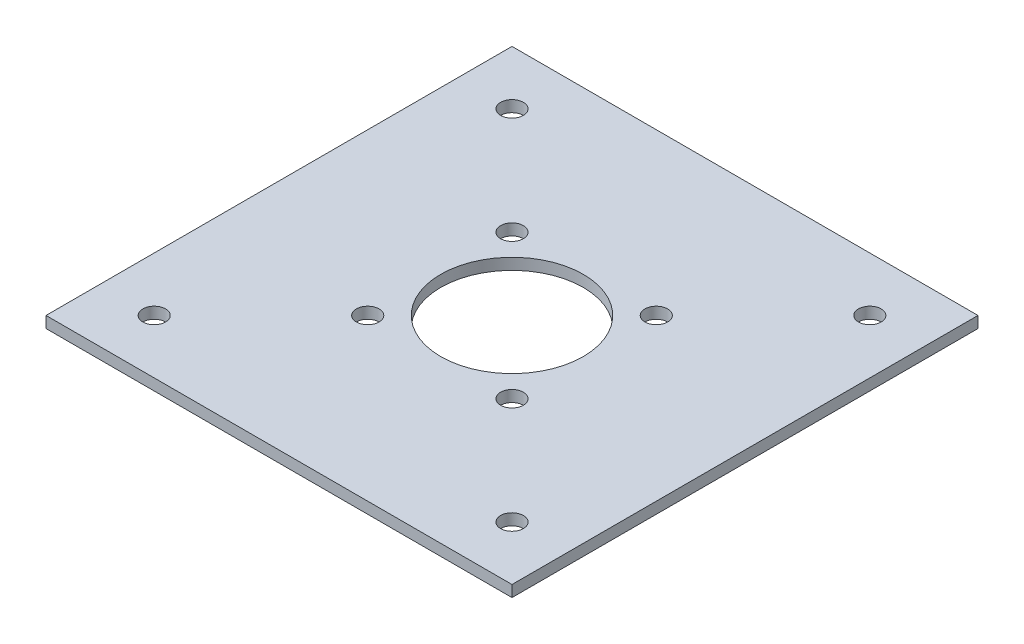
ISO-10303-21;
HEADER;
FILE_DESCRIPTION(('STEP AP214'),'2;1');
FILE_NAME('part.step','',(''),(''),'','','');
FILE_SCHEMA(('AUTOMOTIVE_DESIGN { 1 0 10303 214 1 1 1 1 }'));
ENDSEC;
DATA;
#1=APPLICATION_CONTEXT('core data for automotive mechanical design processes');
#2=APPLICATION_PROTOCOL_DEFINITION('international standard','automotive_design',2000,#1);
#3=PRODUCT_CONTEXT('',#1,'mechanical');
#4=PRODUCT('Part','Part','',(#3));
#5=PRODUCT_RELATED_PRODUCT_CATEGORY('part','',(#4));
#6=PRODUCT_DEFINITION_FORMATION('','',#4);
#7=PRODUCT_DEFINITION_CONTEXT('part definition',#1,'design');
#8=PRODUCT_DEFINITION('design','',#6,#7);
#9=PRODUCT_DEFINITION_SHAPE('','',#8);
#10=(LENGTH_UNIT() NAMED_UNIT(*) SI_UNIT(.MILLI.,.METRE.));
#11=(NAMED_UNIT(*) PLANE_ANGLE_UNIT() SI_UNIT($,.RADIAN.));
#12=(NAMED_UNIT(*) SI_UNIT($,.STERADIAN.) SOLID_ANGLE_UNIT());
#13=UNCERTAINTY_MEASURE_WITH_UNIT(LENGTH_MEASURE(1.E-05),#10,'distance_accuracy_value','');
#14=(GEOMETRIC_REPRESENTATION_CONTEXT(3) GLOBAL_UNCERTAINTY_ASSIGNED_CONTEXT((#13)) GLOBAL_UNIT_ASSIGNED_CONTEXT((#10,
#11,#12)) REPRESENTATION_CONTEXT('',''));
#15=CARTESIAN_POINT('',(0.,0.,0.));
#16=DIRECTION('',(0.,0.,1.));
#17=DIRECTION('',(1.,0.,0.));
#18=AXIS2_PLACEMENT_3D('',#15,#16,#17);
#19=CARTESIAN_POINT('',(0.,2.,-82.042));
#20=DIRECTION('',(0.,-1.,0.));
#21=DIRECTION('',(0.,0.,-1.));
#22=AXIS2_PLACEMENT_3D('',#19,#20,#21);
#23=PLANE('',#22);
#24=CARTESIAN_POINT('',(41.021,2.,-41.021));
#25=DIRECTION('',(0.,1.,0.));
#26=DIRECTION('',(0.,0.,1.));
#27=AXIS2_PLACEMENT_3D('',#24,#25,#26);
#28=CIRCLE('',#27,12.5476);
#29=CARTESIAN_POINT('',(41.021,2.,-28.4734));
#30=VERTEX_POINT('',#29);
#31=EDGE_CURVE('E159',#30,#30,#28,.T.);
#32=ORIENTED_EDGE('',*,*,#31,.F.);
#33=EDGE_LOOP('',(#32));
#34=FACE_BOUND('',#33,.T.);
#35=CARTESIAN_POINT('',(9.52500000000001,2.,-9.52500000000001));
#36=DIRECTION('',(0.,1.,0.));
#37=DIRECTION('',(0.,0.,1.));
#38=AXIS2_PLACEMENT_3D('',#35,#36,#37);
#39=CIRCLE('',#38,2.);
#40=CARTESIAN_POINT('',(9.52500000000001,2.,-7.52500000000001));
#41=VERTEX_POINT('',#40);
#42=EDGE_CURVE('E150',#41,#41,#39,.T.);
#43=ORIENTED_EDGE('',*,*,#42,.F.);
#44=EDGE_LOOP('',(#43));
#45=FACE_BOUND('',#44,.T.);
#46=CARTESIAN_POINT('',(53.721,2.,-53.721));
#47=DIRECTION('',(0.,-1.,0.));
#48=DIRECTION('',(0.,0.,-1.));
#49=AXIS2_PLACEMENT_3D('',#46,#47,#48);
#50=CIRCLE('',#49,2.);
#51=CARTESIAN_POINT('',(53.721,2.,-55.721));
#52=VERTEX_POINT('',#51);
#53=EDGE_CURVE('E132',#52,#52,#50,.T.);
#54=ORIENTED_EDGE('',*,*,#53,.T.);
#55=EDGE_LOOP('',(#54));
#56=FACE_BOUND('',#55,.T.);
#57=CARTESIAN_POINT('',(53.721,2.,-28.321));
#58=DIRECTION('',(0.,1.,0.));
#59=DIRECTION('',(0.,0.,1.));
#60=AXIS2_PLACEMENT_3D('',#57,#58,#59);
#61=CIRCLE('',#60,2.);
#62=CARTESIAN_POINT('',(53.721,2.,-26.321));
#63=VERTEX_POINT('',#62);
#64=EDGE_CURVE('E126',#63,#63,#61,.T.);
#65=ORIENTED_EDGE('',*,*,#64,.F.);
#66=EDGE_LOOP('',(#65));
#67=FACE_BOUND('',#66,.T.);
#68=CARTESIAN_POINT('',(9.52500000000001,2.,-72.517));
#69=DIRECTION('',(0.,-1.,0.));
#70=DIRECTION('',(0.,0.,-1.));
#71=AXIS2_PLACEMENT_3D('',#68,#69,#70);
#72=CIRCLE('',#71,2.);
#73=CARTESIAN_POINT('',(9.52500000000001,2.,-74.517));
#74=VERTEX_POINT('',#73);
#75=EDGE_CURVE('E111',#74,#74,#72,.T.);
#76=ORIENTED_EDGE('',*,*,#75,.T.);
#77=EDGE_LOOP('',(#76));
#78=FACE_BOUND('',#77,.T.);
#79=DIRECTION('',(0.,0.,1.));
#80=VECTOR('',#79,1.);
#81=CARTESIAN_POINT('',(0.,2.,0.));
#82=LINE('',#81,#80);
#83=CARTESIAN_POINT('',(0.,2.,-82.042));
#84=VERTEX_POINT('',#83);
#85=CARTESIAN_POINT('',(0.,2.,0.));
#86=VERTEX_POINT('',#85);
#87=EDGE_CURVE('E84',#84,#86,#82,.T.);
#88=ORIENTED_EDGE('',*,*,#87,.T.);
#89=DIRECTION('',(1.,0.,0.));
#90=VECTOR('',#89,1.);
#91=CARTESIAN_POINT('',(0.,2.,0.));
#92=LINE('',#91,#90);
#93=CARTESIAN_POINT('',(82.042,2.,0.));
#94=VERTEX_POINT('',#93);
#95=EDGE_CURVE('E79',#86,#94,#92,.T.);
#96=ORIENTED_EDGE('',*,*,#95,.T.);
#97=DIRECTION('',(0.,0.,-1.));
#98=VECTOR('',#97,1.);
#99=CARTESIAN_POINT('',(82.042,2.,0.));
#100=LINE('',#99,#98);
#101=CARTESIAN_POINT('',(82.042,2.,-82.042));
#102=VERTEX_POINT('',#101);
#103=EDGE_CURVE('E82',#94,#102,#100,.T.);
#104=ORIENTED_EDGE('',*,*,#103,.T.);
#105=DIRECTION('',(-1.,0.,0.));
#106=VECTOR('',#105,1.);
#107=CARTESIAN_POINT('',(0.,2.,-82.042));
#108=LINE('',#107,#106);
#109=EDGE_CURVE('E49',#102,#84,#108,.T.);
#110=ORIENTED_EDGE('',*,*,#109,.T.);
#111=EDGE_LOOP('',(#88,#96,#104,#110));
#112=FACE_BOUND('',#111,.T.);
#113=CARTESIAN_POINT('',(28.321,2.,-53.721));
#114=DIRECTION('',(0.,1.,0.));
#115=DIRECTION('',(0.,0.,1.));
#116=AXIS2_PLACEMENT_3D('',#113,#114,#115);
#117=CIRCLE('',#116,2.);
#118=CARTESIAN_POINT('',(28.321,2.,-51.721));
#119=VERTEX_POINT('',#118);
#120=EDGE_CURVE('E114',#119,#119,#117,.T.);
#121=ORIENTED_EDGE('',*,*,#120,.F.);
#122=EDGE_LOOP('',(#121));
#123=FACE_BOUND('',#122,.T.);
#124=CARTESIAN_POINT('',(28.321,2.,-28.321));
#125=DIRECTION('',(0.,-1.,0.));
#126=DIRECTION('',(0.,0.,-1.));
#127=AXIS2_PLACEMENT_3D('',#124,#125,#126);
#128=CIRCLE('',#127,2.);
#129=CARTESIAN_POINT('',(28.321,2.,-30.321));
#130=VERTEX_POINT('',#129);
#131=EDGE_CURVE('E120',#130,#130,#128,.T.);
#132=ORIENTED_EDGE('',*,*,#131,.T.);
#133=EDGE_LOOP('',(#132));
#134=FACE_BOUND('',#133,.T.);
#135=CARTESIAN_POINT('',(72.517,2.,-72.517));
#136=DIRECTION('',(0.,1.,0.));
#137=DIRECTION('',(0.,0.,1.));
#138=AXIS2_PLACEMENT_3D('',#135,#136,#137);
#139=CIRCLE('',#138,2.);
#140=CARTESIAN_POINT('',(72.517,2.,-70.517));
#141=VERTEX_POINT('',#140);
#142=EDGE_CURVE('E138',#141,#141,#139,.T.);
#143=ORIENTED_EDGE('',*,*,#142,.F.);
#144=EDGE_LOOP('',(#143));
#145=FACE_BOUND('',#144,.T.);
#146=CARTESIAN_POINT('',(72.517,2.,-9.52500000000001));
#147=DIRECTION('',(0.,-1.,0.));
#148=DIRECTION('',(0.,0.,-1.));
#149=AXIS2_PLACEMENT_3D('',#146,#147,#148);
#150=CIRCLE('',#149,2.);
#151=CARTESIAN_POINT('',(72.517,2.,-11.525));
#152=VERTEX_POINT('',#151);
#153=EDGE_CURVE('E144',#152,#152,#150,.T.);
#154=ORIENTED_EDGE('',*,*,#153,.T.);
#155=EDGE_LOOP('',(#154));
#156=FACE_BOUND('',#155,.T.);
#157=ADVANCED_FACE('F32',(#34,#45,#56,#67,#78,#112,#123,#134,#145,#156),#23,.F.);
#158=CARTESIAN_POINT('',(0.,0.,-82.042));
#159=DIRECTION('',(0.,-1.,0.));
#160=DIRECTION('',(0.,0.,-1.));
#161=AXIS2_PLACEMENT_3D('',#158,#159,#160);
#162=PLANE('',#161);
#163=CARTESIAN_POINT('',(41.021,0.,-41.021));
#164=DIRECTION('',(0.,1.,0.));
#165=DIRECTION('',(0.,0.,1.));
#166=AXIS2_PLACEMENT_3D('',#163,#164,#165);
#167=CIRCLE('',#166,12.5476);
#168=CARTESIAN_POINT('',(41.021,0.,-28.4734));
#169=VERTEX_POINT('',#168);
#170=EDGE_CURVE('E156',#169,#169,#167,.T.);
#171=ORIENTED_EDGE('',*,*,#170,.T.);
#172=EDGE_LOOP('',(#171));
#173=FACE_BOUND('',#172,.T.);
#174=CARTESIAN_POINT('',(9.52500000000001,0.,-9.52500000000001));
#175=DIRECTION('',(0.,1.,0.));
#176=DIRECTION('',(0.,0.,1.));
#177=AXIS2_PLACEMENT_3D('',#174,#175,#176);
#178=CIRCLE('',#177,2.);
#179=CARTESIAN_POINT('',(9.52500000000001,0.,-7.52500000000001));
#180=VERTEX_POINT('',#179);
#181=EDGE_CURVE('E153',#180,#180,#178,.T.);
#182=ORIENTED_EDGE('',*,*,#181,.T.);
#183=EDGE_LOOP('',(#182));
#184=FACE_BOUND('',#183,.T.);
#185=CARTESIAN_POINT('',(53.721,0.,-53.721));
#186=DIRECTION('',(0.,-1.,0.));
#187=DIRECTION('',(0.,0.,-1.));
#188=AXIS2_PLACEMENT_3D('',#185,#186,#187);
#189=CIRCLE('',#188,2.);
#190=CARTESIAN_POINT('',(53.721,0.,-55.721));
#191=VERTEX_POINT('',#190);
#192=EDGE_CURVE('E135',#191,#191,#189,.T.);
#193=ORIENTED_EDGE('',*,*,#192,.F.);
#194=EDGE_LOOP('',(#193));
#195=FACE_BOUND('',#194,.T.);
#196=CARTESIAN_POINT('',(53.721,0.,-28.321));
#197=DIRECTION('',(0.,1.,0.));
#198=DIRECTION('',(0.,0.,1.));
#199=AXIS2_PLACEMENT_3D('',#196,#197,#198);
#200=CIRCLE('',#199,2.);
#201=CARTESIAN_POINT('',(53.721,0.,-26.321));
#202=VERTEX_POINT('',#201);
#203=EDGE_CURVE('E129',#202,#202,#200,.T.);
#204=ORIENTED_EDGE('',*,*,#203,.T.);
#205=EDGE_LOOP('',(#204));
#206=FACE_BOUND('',#205,.T.);
#207=CARTESIAN_POINT('',(9.52500000000001,0.,-72.517));
#208=DIRECTION('',(0.,-1.,0.));
#209=DIRECTION('',(0.,0.,-1.));
#210=AXIS2_PLACEMENT_3D('',#207,#208,#209);
#211=CIRCLE('',#210,2.);
#212=CARTESIAN_POINT('',(9.52500000000001,0.,-74.517));
#213=VERTEX_POINT('',#212);
#214=EDGE_CURVE('E99',#213,#213,#211,.T.);
#215=ORIENTED_EDGE('',*,*,#214,.F.);
#216=EDGE_LOOP('',(#215));
#217=FACE_BOUND('',#216,.T.);
#218=DIRECTION('',(0.,0.,1.));
#219=VECTOR('',#218,1.);
#220=CARTESIAN_POINT('',(0.,0.,0.));
#221=LINE('',#220,#219);
#222=CARTESIAN_POINT('',(0.,0.,-82.042));
#223=VERTEX_POINT('',#222);
#224=CARTESIAN_POINT('',(0.,0.,0.));
#225=VERTEX_POINT('',#224);
#226=EDGE_CURVE('E96',#223,#225,#221,.T.);
#227=ORIENTED_EDGE('',*,*,#226,.F.);
#228=DIRECTION('',(-1.,0.,0.));
#229=VECTOR('',#228,1.);
#230=CARTESIAN_POINT('',(0.,0.,-82.042));
#231=LINE('',#230,#229);
#232=CARTESIAN_POINT('',(82.042,0.,-82.042));
#233=VERTEX_POINT('',#232);
#234=EDGE_CURVE('E72',#233,#223,#231,.T.);
#235=ORIENTED_EDGE('',*,*,#234,.F.);
#236=DIRECTION('',(0.,0.,-1.));
#237=VECTOR('',#236,1.);
#238=CARTESIAN_POINT('',(82.042,0.,0.));
#239=LINE('',#238,#237);
#240=CARTESIAN_POINT('',(82.042,0.,0.));
#241=VERTEX_POINT('',#240);
#242=EDGE_CURVE('E66',#241,#233,#239,.T.);
#243=ORIENTED_EDGE('',*,*,#242,.F.);
#244=DIRECTION('',(1.,0.,0.));
#245=VECTOR('',#244,1.);
#246=CARTESIAN_POINT('',(0.,0.,0.));
#247=LINE('',#246,#245);
#248=EDGE_CURVE('E88',#225,#241,#247,.T.);
#249=ORIENTED_EDGE('',*,*,#248,.F.);
#250=EDGE_LOOP('',(#227,#235,#243,#249));
#251=FACE_BOUND('',#250,.T.);
#252=CARTESIAN_POINT('',(28.321,0.,-53.721));
#253=DIRECTION('',(0.,1.,0.));
#254=DIRECTION('',(0.,0.,1.));
#255=AXIS2_PLACEMENT_3D('',#252,#253,#254);
#256=CIRCLE('',#255,2.);
#257=CARTESIAN_POINT('',(28.321,0.,-51.721));
#258=VERTEX_POINT('',#257);
#259=EDGE_CURVE('E117',#258,#258,#256,.T.);
#260=ORIENTED_EDGE('',*,*,#259,.T.);
#261=EDGE_LOOP('',(#260));
#262=FACE_BOUND('',#261,.T.);
#263=CARTESIAN_POINT('',(28.321,0.,-28.321));
#264=DIRECTION('',(0.,-1.,0.));
#265=DIRECTION('',(0.,0.,-1.));
#266=AXIS2_PLACEMENT_3D('',#263,#264,#265);
#267=CIRCLE('',#266,2.);
#268=CARTESIAN_POINT('',(28.321,0.,-30.321));
#269=VERTEX_POINT('',#268);
#270=EDGE_CURVE('E123',#269,#269,#267,.T.);
#271=ORIENTED_EDGE('',*,*,#270,.F.);
#272=EDGE_LOOP('',(#271));
#273=FACE_BOUND('',#272,.T.);
#274=CARTESIAN_POINT('',(72.517,0.,-72.517));
#275=DIRECTION('',(0.,1.,0.));
#276=DIRECTION('',(0.,0.,1.));
#277=AXIS2_PLACEMENT_3D('',#274,#275,#276);
#278=CIRCLE('',#277,2.);
#279=CARTESIAN_POINT('',(72.517,0.,-70.517));
#280=VERTEX_POINT('',#279);
#281=EDGE_CURVE('E141',#280,#280,#278,.T.);
#282=ORIENTED_EDGE('',*,*,#281,.T.);
#283=EDGE_LOOP('',(#282));
#284=FACE_BOUND('',#283,.T.);
#285=CARTESIAN_POINT('',(72.517,0.,-9.52500000000001));
#286=DIRECTION('',(0.,-1.,0.));
#287=DIRECTION('',(0.,0.,-1.));
#288=AXIS2_PLACEMENT_3D('',#285,#286,#287);
#289=CIRCLE('',#288,2.);
#290=CARTESIAN_POINT('',(72.517,0.,-11.525));
#291=VERTEX_POINT('',#290);
#292=EDGE_CURVE('E147',#291,#291,#289,.T.);
#293=ORIENTED_EDGE('',*,*,#292,.F.);
#294=EDGE_LOOP('',(#293));
#295=FACE_BOUND('',#294,.T.);
#296=ADVANCED_FACE('F107',(#173,#184,#195,#206,#217,#251,#262,#273,#284,#295),#162,.T.);
#297=CARTESIAN_POINT('',(0.,2.,0.));
#298=DIRECTION('',(1.,0.,0.));
#299=DIRECTION('',(0.,0.,-1.));
#300=AXIS2_PLACEMENT_3D('',#297,#298,#299);
#301=PLANE('',#300);
#302=ORIENTED_EDGE('',*,*,#226,.T.);
#303=DIRECTION('',(0.,-1.,0.));
#304=VECTOR('',#303,1.);
#305=CARTESIAN_POINT('',(0.,2.,0.));
#306=LINE('',#305,#304);
#307=EDGE_CURVE('E11',#86,#225,#306,.T.);
#308=ORIENTED_EDGE('',*,*,#307,.F.);
#309=ORIENTED_EDGE('',*,*,#87,.F.);
#310=DIRECTION('',(0.,-1.,0.));
#311=VECTOR('',#310,1.);
#312=CARTESIAN_POINT('',(0.,2.,-82.042));
#313=LINE('',#312,#311);
#314=EDGE_CURVE('E92',#84,#223,#313,.T.);
#315=ORIENTED_EDGE('',*,*,#314,.T.);
#316=EDGE_LOOP('',(#302,#308,#309,#315));
#317=FACE_BOUND('',#316,.T.);
#318=ADVANCED_FACE('F34',(#317),#301,.F.);
#319=CARTESIAN_POINT('',(0.,2.,0.));
#320=DIRECTION('',(0.,0.,-1.));
#321=DIRECTION('',(-1.,0.,0.));
#322=AXIS2_PLACEMENT_3D('',#319,#320,#321);
#323=PLANE('',#322);
#324=ORIENTED_EDGE('',*,*,#248,.T.);
#325=DIRECTION('',(0.,-1.,0.));
#326=VECTOR('',#325,1.);
#327=CARTESIAN_POINT('',(82.042,2.,0.));
#328=LINE('',#327,#326);
#329=EDGE_CURVE('E41',#94,#241,#328,.T.);
#330=ORIENTED_EDGE('',*,*,#329,.F.);
#331=ORIENTED_EDGE('',*,*,#95,.F.);
#332=ORIENTED_EDGE('',*,*,#307,.T.);
#333=EDGE_LOOP('',(#324,#330,#331,#332));
#334=FACE_BOUND('',#333,.T.);
#335=ADVANCED_FACE('F87',(#334),#323,.F.);
#336=CARTESIAN_POINT('',(82.042,2.,0.));
#337=DIRECTION('',(-1.,0.,0.));
#338=DIRECTION('',(0.,0.,1.));
#339=AXIS2_PLACEMENT_3D('',#336,#337,#338);
#340=PLANE('',#339);
#341=ORIENTED_EDGE('',*,*,#242,.T.);
#342=DIRECTION('',(0.,-1.,0.));
#343=VECTOR('',#342,1.);
#344=CARTESIAN_POINT('',(82.042,2.,-82.042));
#345=LINE('',#344,#343);
#346=EDGE_CURVE('E89',#102,#233,#345,.T.);
#347=ORIENTED_EDGE('',*,*,#346,.F.);
#348=ORIENTED_EDGE('',*,*,#103,.F.);
#349=ORIENTED_EDGE('',*,*,#329,.T.);
#350=EDGE_LOOP('',(#341,#347,#348,#349));
#351=FACE_BOUND('',#350,.T.);
#352=ADVANCED_FACE('F90',(#351),#340,.F.);
#353=CARTESIAN_POINT('',(0.,2.,-82.042));
#354=DIRECTION('',(0.,0.,1.));
#355=DIRECTION('',(1.,0.,0.));
#356=AXIS2_PLACEMENT_3D('',#353,#354,#355);
#357=PLANE('',#356);
#358=ORIENTED_EDGE('',*,*,#234,.T.);
#359=ORIENTED_EDGE('',*,*,#314,.F.);
#360=ORIENTED_EDGE('',*,*,#109,.F.);
#361=ORIENTED_EDGE('',*,*,#346,.T.);
#362=EDGE_LOOP('',(#358,#359,#360,#361));
#363=FACE_BOUND('',#362,.T.);
#364=ADVANCED_FACE('F104',(#363),#357,.F.);
#365=CARTESIAN_POINT('',(9.52500000000001,0.,-72.517));
#366=DIRECTION('',(0.,1.,0.));
#367=DIRECTION('',(0.,0.,1.));
#368=AXIS2_PLACEMENT_3D('',#365,#366,#367);
#369=CYLINDRICAL_SURFACE('',#368,2.);
#370=ORIENTED_EDGE('',*,*,#214,.T.);
#371=EDGE_LOOP('',(#370));
#372=FACE_BOUND('',#371,.T.);
#373=ORIENTED_EDGE('',*,*,#75,.F.);
#374=EDGE_LOOP('',(#373));
#375=FACE_BOUND('',#374,.T.);
#376=ADVANCED_FACE('F185',(#372,#375),#369,.F.);
#377=CARTESIAN_POINT('',(28.321,0.,-53.721));
#378=DIRECTION('',(0.,1.,0.));
#379=DIRECTION('',(0.,0.,1.));
#380=AXIS2_PLACEMENT_3D('',#377,#378,#379);
#381=CYLINDRICAL_SURFACE('',#380,2.);
#382=ORIENTED_EDGE('',*,*,#259,.F.);
#383=EDGE_LOOP('',(#382));
#384=FACE_BOUND('',#383,.T.);
#385=ORIENTED_EDGE('',*,*,#120,.T.);
#386=EDGE_LOOP('',(#385));
#387=FACE_BOUND('',#386,.T.);
#388=ADVANCED_FACE('F187',(#384,#387),#381,.F.);
#389=CARTESIAN_POINT('',(28.321,0.,-28.321));
#390=DIRECTION('',(0.,1.,0.));
#391=DIRECTION('',(0.,0.,1.));
#392=AXIS2_PLACEMENT_3D('',#389,#390,#391);
#393=CYLINDRICAL_SURFACE('',#392,2.);
#394=ORIENTED_EDGE('',*,*,#270,.T.);
#395=EDGE_LOOP('',(#394));
#396=FACE_BOUND('',#395,.T.);
#397=ORIENTED_EDGE('',*,*,#131,.F.);
#398=EDGE_LOOP('',(#397));
#399=FACE_BOUND('',#398,.T.);
#400=ADVANCED_FACE('F194',(#396,#399),#393,.F.);
#401=CARTESIAN_POINT('',(53.721,0.,-28.321));
#402=DIRECTION('',(0.,1.,0.));
#403=DIRECTION('',(0.,0.,1.));
#404=AXIS2_PLACEMENT_3D('',#401,#402,#403);
#405=CYLINDRICAL_SURFACE('',#404,2.);
#406=ORIENTED_EDGE('',*,*,#203,.F.);
#407=EDGE_LOOP('',(#406));
#408=FACE_BOUND('',#407,.T.);
#409=ORIENTED_EDGE('',*,*,#64,.T.);
#410=EDGE_LOOP('',(#409));
#411=FACE_BOUND('',#410,.T.);
#412=ADVANCED_FACE('F259',(#408,#411),#405,.F.);
#413=CARTESIAN_POINT('',(53.721,0.,-53.721));
#414=DIRECTION('',(0.,1.,0.));
#415=DIRECTION('',(0.,0.,1.));
#416=AXIS2_PLACEMENT_3D('',#413,#414,#415);
#417=CYLINDRICAL_SURFACE('',#416,2.);
#418=ORIENTED_EDGE('',*,*,#192,.T.);
#419=EDGE_LOOP('',(#418));
#420=FACE_BOUND('',#419,.T.);
#421=ORIENTED_EDGE('',*,*,#53,.F.);
#422=EDGE_LOOP('',(#421));
#423=FACE_BOUND('',#422,.T.);
#424=ADVANCED_FACE('F249',(#420,#423),#417,.F.);
#425=CARTESIAN_POINT('',(72.517,0.,-72.517));
#426=DIRECTION('',(0.,1.,0.));
#427=DIRECTION('',(0.,0.,1.));
#428=AXIS2_PLACEMENT_3D('',#425,#426,#427);
#429=CYLINDRICAL_SURFACE('',#428,2.);
#430=ORIENTED_EDGE('',*,*,#281,.F.);
#431=EDGE_LOOP('',(#430));
#432=FACE_BOUND('',#431,.T.);
#433=ORIENTED_EDGE('',*,*,#142,.T.);
#434=EDGE_LOOP('',(#433));
#435=FACE_BOUND('',#434,.T.);
#436=ADVANCED_FACE('F239',(#432,#435),#429,.F.);
#437=CARTESIAN_POINT('',(72.517,0.,-9.52500000000001));
#438=DIRECTION('',(0.,1.,0.));
#439=DIRECTION('',(0.,0.,1.));
#440=AXIS2_PLACEMENT_3D('',#437,#438,#439);
#441=CYLINDRICAL_SURFACE('',#440,2.);
#442=ORIENTED_EDGE('',*,*,#292,.T.);
#443=EDGE_LOOP('',(#442));
#444=FACE_BOUND('',#443,.T.);
#445=ORIENTED_EDGE('',*,*,#153,.F.);
#446=EDGE_LOOP('',(#445));
#447=FACE_BOUND('',#446,.T.);
#448=ADVANCED_FACE('F228',(#444,#447),#441,.F.);
#449=CARTESIAN_POINT('',(9.52500000000001,0.,-9.52500000000001));
#450=DIRECTION('',(0.,1.,0.));
#451=DIRECTION('',(0.,0.,1.));
#452=AXIS2_PLACEMENT_3D('',#449,#450,#451);
#453=CYLINDRICAL_SURFACE('',#452,2.);
#454=ORIENTED_EDGE('',*,*,#181,.F.);
#455=EDGE_LOOP('',(#454));
#456=FACE_BOUND('',#455,.T.);
#457=ORIENTED_EDGE('',*,*,#42,.T.);
#458=EDGE_LOOP('',(#457));
#459=FACE_BOUND('',#458,.T.);
#460=ADVANCED_FACE('F170',(#456,#459),#453,.F.);
#461=CARTESIAN_POINT('',(41.021,0.,-41.021));
#462=DIRECTION('',(0.,1.,0.));
#463=DIRECTION('',(0.,0.,1.));
#464=AXIS2_PLACEMENT_3D('',#461,#462,#463);
#465=CYLINDRICAL_SURFACE('',#464,12.5476);
#466=ORIENTED_EDGE('',*,*,#170,.F.);
#467=EDGE_LOOP('',(#466));
#468=FACE_BOUND('',#467,.T.);
#469=ORIENTED_EDGE('',*,*,#31,.T.);
#470=EDGE_LOOP('',(#469));
#471=FACE_BOUND('',#470,.T.);
#472=ADVANCED_FACE('F167',(#468,#471),#465,.F.);
#473=CLOSED_SHELL('',(#157,#296,#318,#335,#352,#364,#376,#388,#400,#412,#424,#436,#448,#460,#472));
#474=MANIFOLD_SOLID_BREP('B2',#473);
#475=ADVANCED_BREP_SHAPE_REPRESENTATION('',(#18,#474),#14);
#476=SHAPE_DEFINITION_REPRESENTATION(#9,#475);
ENDSEC;
END-ISO-10303-21;
